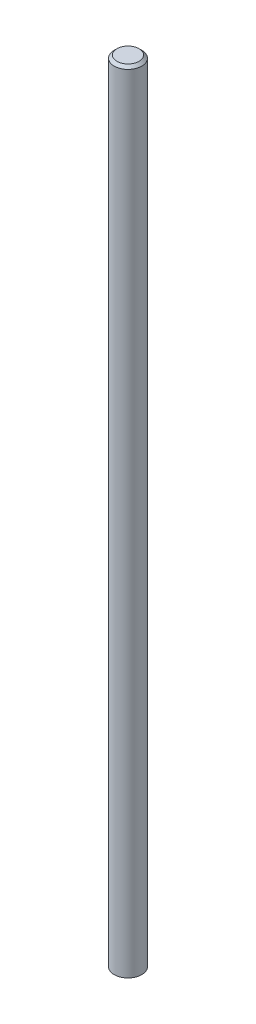
ISO-10303-21;
HEADER;
FILE_DESCRIPTION(('STEP AP214'),'2;1');
FILE_NAME('part.step','',(''),(''),'','','');
FILE_SCHEMA(('AUTOMOTIVE_DESIGN { 1 0 10303 214 1 1 1 1 }'));
ENDSEC;
DATA;
#1=APPLICATION_CONTEXT('core data for automotive mechanical design processes');
#2=APPLICATION_PROTOCOL_DEFINITION('international standard','automotive_design',2000,#1);
#3=PRODUCT_CONTEXT('',#1,'mechanical');
#4=PRODUCT('Part','Part','',(#3));
#5=PRODUCT_RELATED_PRODUCT_CATEGORY('part','',(#4));
#6=PRODUCT_DEFINITION_FORMATION('','',#4);
#7=PRODUCT_DEFINITION_CONTEXT('part definition',#1,'design');
#8=PRODUCT_DEFINITION('design','',#6,#7);
#9=PRODUCT_DEFINITION_SHAPE('','',#8);
#10=(LENGTH_UNIT() NAMED_UNIT(*) SI_UNIT(.MILLI.,.METRE.));
#11=(NAMED_UNIT(*) PLANE_ANGLE_UNIT() SI_UNIT($,.RADIAN.));
#12=(NAMED_UNIT(*) SI_UNIT($,.STERADIAN.) SOLID_ANGLE_UNIT());
#13=UNCERTAINTY_MEASURE_WITH_UNIT(LENGTH_MEASURE(1.E-05),#10,'distance_accuracy_value','');
#14=(GEOMETRIC_REPRESENTATION_CONTEXT(3) GLOBAL_UNCERTAINTY_ASSIGNED_CONTEXT((#13)) GLOBAL_UNIT_ASSIGNED_CONTEXT((#10,
#11,#12)) REPRESENTATION_CONTEXT('',''));
#15=CARTESIAN_POINT('',(0.,0.,0.));
#16=DIRECTION('',(0.,0.,1.));
#17=DIRECTION('',(1.,0.,0.));
#18=AXIS2_PLACEMENT_3D('',#15,#16,#17);
#19=CARTESIAN_POINT('',(0.,86.,0.));
#20=DIRECTION('',(0.,-1.,0.));
#21=DIRECTION('',(0.,0.,-1.));
#22=AXIS2_PLACEMENT_3D('',#19,#20,#21);
#23=CYLINDRICAL_SURFACE('',#22,1.5);
#24=CARTESIAN_POINT('',(0.,85.7,0.));
#25=DIRECTION('',(0.,1.,0.));
#26=DIRECTION('',(0.,0.,1.));
#27=AXIS2_PLACEMENT_3D('',#24,#25,#26);
#28=CIRCLE('',#27,1.5);
#29=CARTESIAN_POINT('',(0.,85.7,1.5));
#30=VERTEX_POINT('',#29);
#31=EDGE_CURVE('E10',#30,#30,#28,.F.);
#32=ORIENTED_EDGE('',*,*,#31,.T.);
#33=EDGE_LOOP('',(#32));
#34=FACE_BOUND('',#33,.T.);
#35=CARTESIAN_POINT('',(0.,0.,0.));
#36=DIRECTION('',(0.,1.,0.));
#37=DIRECTION('',(0.,0.,1.));
#38=AXIS2_PLACEMENT_3D('',#35,#36,#37);
#39=CIRCLE('',#38,1.5);
#40=CARTESIAN_POINT('',(0.,0.,1.5));
#41=VERTEX_POINT('',#40);
#42=EDGE_CURVE('E45',#41,#41,#39,.T.);
#43=ORIENTED_EDGE('',*,*,#42,.T.);
#44=EDGE_LOOP('',(#43));
#45=FACE_BOUND('',#44,.T.);
#46=ADVANCED_FACE('F34',(#34,#45),#23,.T.);
#47=CARTESIAN_POINT('',(0.,86.,0.));
#48=DIRECTION('',(0.,1.,0.));
#49=DIRECTION('',(0.,0.,1.));
#50=AXIS2_PLACEMENT_3D('',#47,#48,#49);
#51=PLANE('',#50);
#52=CARTESIAN_POINT('',(0.,86.,0.));
#53=DIRECTION('',(0.,1.,0.));
#54=DIRECTION('',(0.,0.,1.));
#55=AXIS2_PLACEMENT_3D('',#52,#53,#54);
#56=CIRCLE('',#55,1.20000000000001);
#57=CARTESIAN_POINT('',(0.,86.,1.20000000000001));
#58=VERTEX_POINT('',#57);
#59=EDGE_CURVE('E41',#58,#58,#56,.T.);
#60=ORIENTED_EDGE('',*,*,#59,.T.);
#61=EDGE_LOOP('',(#60));
#62=FACE_BOUND('',#61,.T.);
#63=ADVANCED_FACE('F55',(#62),#51,.T.);
#64=CARTESIAN_POINT('',(0.,0.,0.));
#65=DIRECTION('',(0.,1.,0.));
#66=DIRECTION('',(0.,0.,1.));
#67=AXIS2_PLACEMENT_3D('',#64,#65,#66);
#68=PLANE('',#67);
#69=ORIENTED_EDGE('',*,*,#42,.F.);
#70=EDGE_LOOP('',(#69));
#71=FACE_BOUND('',#70,.T.);
#72=ADVANCED_FACE('F53',(#71),#68,.F.);
#73=CARTESIAN_POINT('',(0.,86.,0.));
#74=DIRECTION('',(0.,-1.,0.));
#75=DIRECTION('',(0.,0.,-1.));
#76=AXIS2_PLACEMENT_3D('',#73,#74,#75);
#77=CONICAL_SURFACE('',#76,1.20000000000001,0.785398163397458);
#78=ORIENTED_EDGE('',*,*,#31,.F.);
#79=EDGE_LOOP('',(#78));
#80=FACE_BOUND('',#79,.T.);
#81=ORIENTED_EDGE('',*,*,#59,.F.);
#82=EDGE_LOOP('',(#81));
#83=FACE_BOUND('',#82,.T.);
#84=ADVANCED_FACE('F36',(#80,#83),#77,.T.);
#85=CLOSED_SHELL('',(#46,#63,#72,#84));
#86=MANIFOLD_SOLID_BREP('B2',#85);
#87=ADVANCED_BREP_SHAPE_REPRESENTATION('',(#18,#86),#14);
#88=SHAPE_DEFINITION_REPRESENTATION(#9,#87);
ENDSEC;
END-ISO-10303-21;
